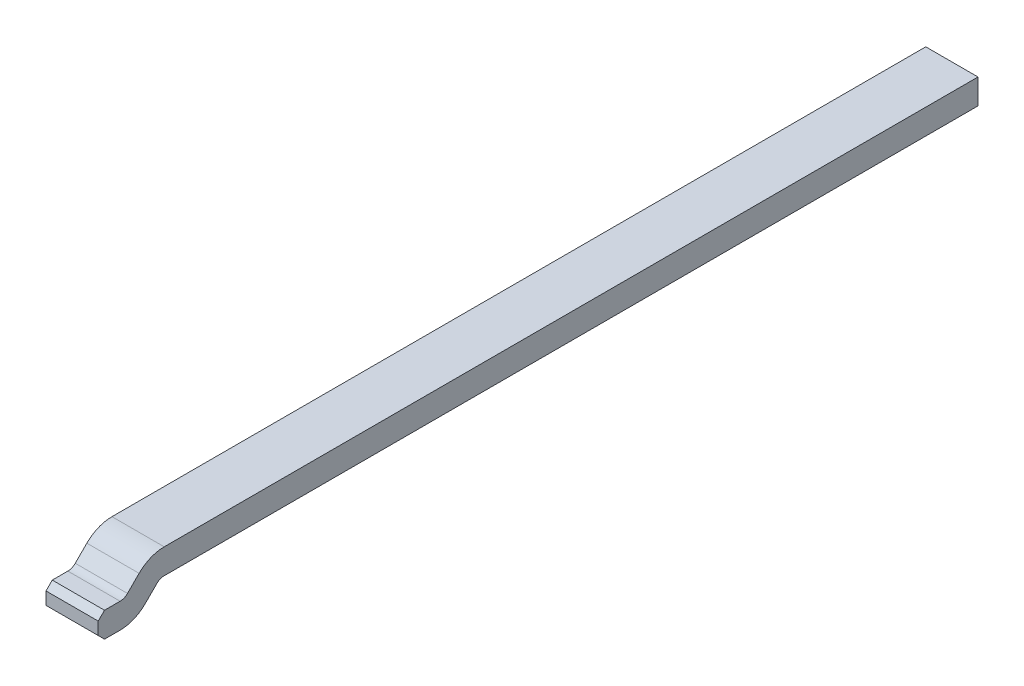
ISO-10303-21;
HEADER;
FILE_DESCRIPTION(('STEP AP214'),'2;1');
FILE_NAME('part.step','',(''),(''),'','','');
FILE_SCHEMA(('AUTOMOTIVE_DESIGN { 1 0 10303 214 1 1 1 1 }'));
ENDSEC;
DATA;
#1=APPLICATION_CONTEXT('core data for automotive mechanical design processes');
#2=APPLICATION_PROTOCOL_DEFINITION('international standard','automotive_design',2000,#1);
#3=PRODUCT_CONTEXT('',#1,'mechanical');
#4=PRODUCT('Part','Part','',(#3));
#5=PRODUCT_RELATED_PRODUCT_CATEGORY('part','',(#4));
#6=PRODUCT_DEFINITION_FORMATION('','',#4);
#7=PRODUCT_DEFINITION_CONTEXT('part definition',#1,'design');
#8=PRODUCT_DEFINITION('design','',#6,#7);
#9=PRODUCT_DEFINITION_SHAPE('','',#8);
#10=(LENGTH_UNIT() NAMED_UNIT(*) SI_UNIT(.MILLI.,.METRE.));
#11=(NAMED_UNIT(*) PLANE_ANGLE_UNIT() SI_UNIT($,.RADIAN.));
#12=(NAMED_UNIT(*) SI_UNIT($,.STERADIAN.) SOLID_ANGLE_UNIT());
#13=UNCERTAINTY_MEASURE_WITH_UNIT(LENGTH_MEASURE(1.E-05),#10,'distance_accuracy_value','');
#14=(GEOMETRIC_REPRESENTATION_CONTEXT(3) GLOBAL_UNCERTAINTY_ASSIGNED_CONTEXT((#13)) GLOBAL_UNIT_ASSIGNED_CONTEXT((#10,
#11,#12)) REPRESENTATION_CONTEXT('',''));
#15=CARTESIAN_POINT('',(0.,0.,0.));
#16=DIRECTION('',(0.,0.,1.));
#17=DIRECTION('',(1.,0.,0.));
#18=AXIS2_PLACEMENT_3D('',#15,#16,#17);
#19=CARTESIAN_POINT('',(16.66210814532,12.93951558355,-10.71169883308));
#20=DIRECTION('',(-1.,0.,0.));
#21=DIRECTION('',(0.,1.,0.));
#22=AXIS2_PLACEMENT_3D('',#19,#20,#21);
#23=PLANE('',#22);
#24=DIRECTION('',(0.,1.,0.));
#25=VECTOR('',#24,1.);
#26=CARTESIAN_POINT('',(16.66210814532,11.48941215274,-9.67169883308));
#27=LINE('',#26,#25);
#28=CARTESIAN_POINT('',(16.6621081893693,13.39951558355,-9.67169883308001));
#29=VERTEX_POINT('',#28);
#30=CARTESIAN_POINT('',(16.662108189363,13.51951558355,-9.67169883308001));
#31=VERTEX_POINT('',#30);
#32=EDGE_CURVE('E28',#29,#31,#27,.T.);
#33=ORIENTED_EDGE('',*,*,#32,.F.);
#34=DIRECTION('',(0.,0.,-1.));
#35=VECTOR('',#34,1.);
#36=CARTESIAN_POINT('',(16.66210823377,13.39951558355,-5.731698833076));
#37=LINE('',#36,#35);
#38=CARTESIAN_POINT('',(16.6621082334123,13.39951558355,-5.77711513867901));
#39=VERTEX_POINT('',#38);
#40=EDGE_CURVE('E127',#39,#29,#37,.T.);
#41=ORIENTED_EDGE('',*,*,#40,.F.);
#42=CARTESIAN_POINT('',(16.66210823377,13.34951558355,-5.777115138679));
#43=DIRECTION('',(-1.,0.,0.));
#44=DIRECTION('',(0.,0.,1.));
#45=AXIS2_PLACEMENT_3D('',#42,#43,#44);
#46=CIRCLE('',#45,0.05);
#47=CARTESIAN_POINT('',(16.6621082334123,13.3848709226099,-5.74175979962007));
#48=VERTEX_POINT('',#47);
#49=EDGE_CURVE('E219',#48,#39,#46,.T.);
#50=ORIENTED_EDGE('',*,*,#49,.F.);
#51=DIRECTION('',(0.,0.707106781180048,-0.707106781193047));
#52=VECTOR('',#51,1.);
#53=CARTESIAN_POINT('',(16.66210823377,13.32930743075,-5.686196307759));
#54=LINE('',#53,#52);
#55=CARTESIAN_POINT('',(16.6621082334123,13.3293074307494,-5.6861963077595));
#56=VERTEX_POINT('',#55);
#57=EDGE_CURVE('E239',#56,#48,#54,.T.);
#58=ORIENTED_EDGE('',*,*,#57,.F.);
#59=CARTESIAN_POINT('',(16.66210823377,13.44951558355,-5.565988154957));
#60=DIRECTION('',(1.,0.,0.));
#61=DIRECTION('',(0.,0.,1.));
#62=AXIS2_PLACEMENT_3D('',#59,#60,#61);
#63=CIRCLE('',#62,0.17);
#64=CARTESIAN_POINT('',(16.6621082334123,13.27951558355,-5.565988154957));
#65=VERTEX_POINT('',#64);
#66=EDGE_CURVE('E232',#65,#56,#63,.T.);
#67=ORIENTED_EDGE('',*,*,#66,.F.);
#68=DIRECTION('',(0.,0.,-1.));
#69=VECTOR('',#68,1.);
#70=CARTESIAN_POINT('',(16.66210823377,13.27951558355,-5.731698833076));
#71=LINE('',#70,#69);
#72=CARTESIAN_POINT('',(16.6621082334123,13.27951558355,-5.491404460561));
#73=VERTEX_POINT('',#72);
#74=EDGE_CURVE('E87',#73,#65,#71,.T.);
#75=ORIENTED_EDGE('',*,*,#74,.F.);
#76=DIRECTION('',(0.,-0.707106781186548,-0.707106781186548));
#77=VECTOR('',#76,1.);
#78=CARTESIAN_POINT('',(16.66210823377,13.30951558355,-5.461404460561));
#79=LINE('',#78,#77);
#80=CARTESIAN_POINT('',(16.6621082334123,13.30951558355,-5.461404460561));
#81=VERTEX_POINT('',#80);
#82=EDGE_CURVE('E230',#81,#73,#79,.T.);
#83=ORIENTED_EDGE('',*,*,#82,.F.);
#84=DIRECTION('',(0.,-1.,0.));
#85=VECTOR('',#84,1.);
#86=CARTESIAN_POINT('',(16.66210823377,13.39951558355,-5.461404460561));
#87=LINE('',#86,#85);
#88=CARTESIAN_POINT('',(16.6621082334123,13.36951558355,-5.461404460561));
#89=VERTEX_POINT('',#88);
#90=EDGE_CURVE('E215',#89,#81,#87,.T.);
#91=ORIENTED_EDGE('',*,*,#90,.F.);
#92=DIRECTION('',(0.,-0.707106781186548,0.707106781186548));
#93=VECTOR('',#92,1.);
#94=CARTESIAN_POINT('',(16.66210823377,13.39951558355,-5.491404460561));
#95=LINE('',#94,#93);
#96=CARTESIAN_POINT('',(16.6621082334123,13.39951558355,-5.491404460561));
#97=VERTEX_POINT('',#96);
#98=EDGE_CURVE('E291',#97,#89,#95,.T.);
#99=ORIENTED_EDGE('',*,*,#98,.F.);
#100=DIRECTION('',(0.,0.,1.));
#101=VECTOR('',#100,1.);
#102=CARTESIAN_POINT('',(16.66210823377,13.39951558355,-5.731698833076));
#103=LINE('',#102,#101);
#104=CARTESIAN_POINT('',(16.6621082334123,13.39951558355,-5.565988154957));
#105=VERTEX_POINT('',#104);
#106=EDGE_CURVE('E287',#105,#97,#103,.T.);
#107=ORIENTED_EDGE('',*,*,#106,.F.);
#108=CARTESIAN_POINT('',(16.66210823377,13.44951558355,-5.565988154957));
#109=DIRECTION('',(-1.,0.,0.));
#110=DIRECTION('',(0.,0.,-1.));
#111=AXIS2_PLACEMENT_3D('',#108,#109,#110);
#112=CIRCLE('',#111,0.05);
#113=CARTESIAN_POINT('',(16.6621082334123,13.4141602444906,-5.60134349401644));
#114=VERTEX_POINT('',#113);
#115=EDGE_CURVE('E299',#114,#105,#112,.T.);
#116=ORIENTED_EDGE('',*,*,#115,.F.);
#117=DIRECTION('',(0.,-0.707106781180048,0.707106781193047));
#118=VECTOR('',#117,1.);
#119=CARTESIAN_POINT('',(16.66210823377,13.46972373635,-5.656906985878));
#120=LINE('',#119,#118);
#121=CARTESIAN_POINT('',(16.6621082334123,13.4697237363508,-5.65690698587733));
#122=VERTEX_POINT('',#121);
#123=EDGE_CURVE('E190',#122,#114,#120,.T.);
#124=ORIENTED_EDGE('',*,*,#123,.F.);
#125=CARTESIAN_POINT('',(16.66210823377,13.34951558355,-5.777115138679));
#126=DIRECTION('',(1.,0.,0.));
#127=DIRECTION('',(0.,0.,1.));
#128=AXIS2_PLACEMENT_3D('',#125,#126,#127);
#129=CIRCLE('',#128,0.17);
#130=CARTESIAN_POINT('',(16.6621082334123,13.51951558355,-5.77711513867901));
#131=VERTEX_POINT('',#130);
#132=EDGE_CURVE('E183',#131,#122,#129,.T.);
#133=ORIENTED_EDGE('',*,*,#132,.F.);
#134=DIRECTION('',(0.,0.,1.));
#135=VECTOR('',#134,1.);
#136=CARTESIAN_POINT('',(16.66210823377,13.51951558355,-7.369063364689));
#137=LINE('',#136,#135);
#138=EDGE_CURVE('E175',#31,#131,#137,.T.);
#139=ORIENTED_EDGE('',*,*,#138,.F.);
#140=EDGE_LOOP('',(#33,#41,#50,#58,#67,#75,#83,#91,#99,#107,#116,#124,#133,#139));
#141=FACE_BOUND('',#140,.T.);
#142=ADVANCED_FACE('F17',(#141),#23,.T.);
#143=CARTESIAN_POINT('',(16.91210814532,12.93951558355,-11.91169883308));
#144=DIRECTION('',(1.,0.,0.));
#145=DIRECTION('',(0.,0.,-1.));
#146=AXIS2_PLACEMENT_3D('',#143,#144,#145);
#147=PLANE('',#146);
#148=DIRECTION('',(0.,0.,-1.));
#149=VECTOR('',#148,1.);
#150=CARTESIAN_POINT('',(16.91210823377,13.39951558355,-12.98169883308));
#151=LINE('',#150,#149);
#152=CARTESIAN_POINT('',(16.9121082334123,13.39951558355,-5.77711513867901));
#153=VERTEX_POINT('',#152);
#154=CARTESIAN_POINT('',(16.9121082334123,13.39951558355,-9.67169883308001));
#155=VERTEX_POINT('',#154);
#156=EDGE_CURVE('E119',#153,#155,#151,.T.);
#157=ORIENTED_EDGE('',*,*,#156,.T.);
#158=DIRECTION('',(0.,1.,0.));
#159=VECTOR('',#158,1.);
#160=CARTESIAN_POINT('',(16.91210823377,11.48941215274,-9.67169883308));
#161=LINE('',#160,#159);
#162=CARTESIAN_POINT('',(16.9121082334123,13.51951558355,-9.67169883308001));
#163=VERTEX_POINT('',#162);
#164=EDGE_CURVE('E11',#155,#163,#161,.T.);
#165=ORIENTED_EDGE('',*,*,#164,.T.);
#166=DIRECTION('',(0.,0.,-1.));
#167=VECTOR('',#166,1.);
#168=CARTESIAN_POINT('',(16.91210823377,13.51951558355,-7.369063364689));
#169=LINE('',#168,#167);
#170=CARTESIAN_POINT('',(16.9121082334123,13.51951558355,-5.77711513867901));
#171=VERTEX_POINT('',#170);
#172=EDGE_CURVE('E165',#171,#163,#169,.T.);
#173=ORIENTED_EDGE('',*,*,#172,.F.);
#174=CARTESIAN_POINT('',(16.91210823377,13.34951558355,-5.777115138679));
#175=DIRECTION('',(1.,0.,0.));
#176=DIRECTION('',(0.,0.,1.));
#177=AXIS2_PLACEMENT_3D('',#174,#175,#176);
#178=CIRCLE('',#177,0.17);
#179=CARTESIAN_POINT('',(16.9121082334123,13.4697237363509,-5.65690698587746));
#180=VERTEX_POINT('',#179);
#181=EDGE_CURVE('E21',#171,#180,#178,.T.);
#182=ORIENTED_EDGE('',*,*,#181,.T.);
#183=DIRECTION('',(0.,-0.707106781174048,0.707106781199048));
#184=VECTOR('',#183,1.);
#185=CARTESIAN_POINT('',(16.91210823377,13.46972373635,-5.656906985878));
#186=LINE('',#185,#184);
#187=CARTESIAN_POINT('',(16.9121082334123,13.4141602444907,-5.60134349401622));
#188=VERTEX_POINT('',#187);
#189=EDGE_CURVE('E203',#180,#188,#186,.T.);
#190=ORIENTED_EDGE('',*,*,#189,.T.);
#191=CARTESIAN_POINT('',(16.91210823377,13.44951558355,-5.565988154957));
#192=DIRECTION('',(-1.,0.,0.));
#193=DIRECTION('',(0.,0.,-1.));
#194=AXIS2_PLACEMENT_3D('',#191,#192,#193);
#195=CIRCLE('',#194,0.05);
#196=CARTESIAN_POINT('',(16.9121082334123,13.39951558355,-5.565988154957));
#197=VERTEX_POINT('',#196);
#198=EDGE_CURVE('E282',#188,#197,#195,.T.);
#199=ORIENTED_EDGE('',*,*,#198,.T.);
#200=DIRECTION('',(0.,0.,1.));
#201=VECTOR('',#200,1.);
#202=CARTESIAN_POINT('',(16.91210823377,13.39951558355,-12.98169883308));
#203=LINE('',#202,#201);
#204=CARTESIAN_POINT('',(16.9121082334123,13.39951558355,-5.491404460561));
#205=VERTEX_POINT('',#204);
#206=EDGE_CURVE('E295',#197,#205,#203,.T.);
#207=ORIENTED_EDGE('',*,*,#206,.T.);
#208=DIRECTION('',(0.,-0.707106781186548,0.707106781186548));
#209=VECTOR('',#208,1.);
#210=CARTESIAN_POINT('',(16.91210823377,13.39951558355,-5.491404460561));
#211=LINE('',#210,#209);
#212=CARTESIAN_POINT('',(16.9121082334123,13.36951558355,-5.461404460561));
#213=VERTEX_POINT('',#212);
#214=EDGE_CURVE('E211',#205,#213,#211,.T.);
#215=ORIENTED_EDGE('',*,*,#214,.T.);
#216=DIRECTION('',(0.,-1.,0.));
#217=VECTOR('',#216,1.);
#218=CARTESIAN_POINT('',(16.91210823377,13.67951558355,-5.461404460561));
#219=LINE('',#218,#217);
#220=CARTESIAN_POINT('',(16.9121082334123,13.30951558355,-5.461404460561));
#221=VERTEX_POINT('',#220);
#222=EDGE_CURVE('E207',#213,#221,#219,.T.);
#223=ORIENTED_EDGE('',*,*,#222,.T.);
#224=DIRECTION('',(0.,-0.707106781186548,-0.707106781186548));
#225=VECTOR('',#224,1.);
#226=CARTESIAN_POINT('',(16.91210823377,13.30951558355,-5.461404460561));
#227=LINE('',#226,#225);
#228=CARTESIAN_POINT('',(16.9121082334123,13.27951558355,-5.491404460561));
#229=VERTEX_POINT('',#228);
#230=EDGE_CURVE('E71',#221,#229,#227,.T.);
#231=ORIENTED_EDGE('',*,*,#230,.T.);
#232=DIRECTION('',(0.,0.,-1.));
#233=VECTOR('',#232,1.);
#234=CARTESIAN_POINT('',(16.91210823377,13.27951558355,-12.98169883308));
#235=LINE('',#234,#233);
#236=CARTESIAN_POINT('',(16.9121082334123,13.27951558355,-5.565988154957));
#237=VERTEX_POINT('',#236);
#238=EDGE_CURVE('E227',#229,#237,#235,.T.);
#239=ORIENTED_EDGE('',*,*,#238,.T.);
#240=CARTESIAN_POINT('',(16.91210823377,13.44951558355,-5.565988154957));
#241=DIRECTION('',(1.,0.,0.));
#242=DIRECTION('',(0.,0.,1.));
#243=AXIS2_PLACEMENT_3D('',#240,#241,#242);
#244=CIRCLE('',#243,0.17);
#245=CARTESIAN_POINT('',(16.9121082334123,13.3293074307494,-5.68619630775951));
#246=VERTEX_POINT('',#245);
#247=EDGE_CURVE('E236',#237,#246,#244,.T.);
#248=ORIENTED_EDGE('',*,*,#247,.T.);
#249=DIRECTION('',(0.,0.707106781180048,-0.707106781193047));
#250=VECTOR('',#249,1.);
#251=CARTESIAN_POINT('',(16.91210823377,13.32930743075,-5.686196307759));
#252=LINE('',#251,#250);
#253=CARTESIAN_POINT('',(16.9121082334123,13.3848709226099,-5.74175979962007));
#254=VERTEX_POINT('',#253);
#255=EDGE_CURVE('E252',#246,#254,#252,.T.);
#256=ORIENTED_EDGE('',*,*,#255,.T.);
#257=CARTESIAN_POINT('',(16.91210823377,13.34951558355,-5.777115138679));
#258=DIRECTION('',(-1.,0.,0.));
#259=DIRECTION('',(0.,0.,1.));
#260=AXIS2_PLACEMENT_3D('',#257,#258,#259);
#261=CIRCLE('',#260,0.05);
#262=EDGE_CURVE('E216',#254,#153,#261,.T.);
#263=ORIENTED_EDGE('',*,*,#262,.T.);
#264=EDGE_LOOP('',(#157,#165,#173,#182,#190,#199,#207,#215,#223,#231,#239,#248,#256,#263));
#265=FACE_BOUND('',#264,.T.);
#266=ADVANCED_FACE('F167',(#265),#147,.T.);
#267=CARTESIAN_POINT('',(13.11210817501,5.079903349409,-9.67169883308));
#268=DIRECTION('',(0.,0.,-1.));
#269=DIRECTION('',(-1.,0.,0.));
#270=AXIS2_PLACEMENT_3D('',#267,#268,#269);
#271=PLANE('',#270);
#272=DIRECTION('',(1.,0.,0.));
#273=VECTOR('',#272,1.);
#274=CARTESIAN_POINT('',(12.51210817501,13.39951558355,-9.67169883308));
#275=LINE('',#274,#273);
#276=EDGE_CURVE('E224',#29,#155,#275,.T.);
#277=ORIENTED_EDGE('',*,*,#276,.F.);
#278=ORIENTED_EDGE('',*,*,#32,.T.);
#279=DIRECTION('',(-1.,0.,0.));
#280=VECTOR('',#279,1.);
#281=CARTESIAN_POINT('',(13.0621082047,13.51951558355,-9.67169883308));
#282=LINE('',#281,#280);
#283=EDGE_CURVE('E248',#163,#31,#282,.T.);
#284=ORIENTED_EDGE('',*,*,#283,.F.);
#285=ORIENTED_EDGE('',*,*,#164,.F.);
#286=EDGE_LOOP('',(#277,#278,#284,#285));
#287=FACE_BOUND('',#286,.T.);
#288=ADVANCED_FACE('F450',(#287),#271,.T.);
#289=CARTESIAN_POINT('',(12.5121082047,13.39951558355,-11.38169883308));
#290=DIRECTION('',(0.,1.,0.));
#291=DIRECTION('',(1.,0.,0.));
#292=AXIS2_PLACEMENT_3D('',#289,#290,#291);
#293=PLANE('',#292);
#294=ORIENTED_EDGE('',*,*,#156,.F.);
#295=DIRECTION('',(1.,0.,0.));
#296=VECTOR('',#295,1.);
#297=CARTESIAN_POINT('',(12.5121082047,13.39951558355,-5.777115138679));
#298=LINE('',#297,#296);
#299=EDGE_CURVE('E174',#39,#153,#298,.T.);
#300=ORIENTED_EDGE('',*,*,#299,.F.);
#301=ORIENTED_EDGE('',*,*,#40,.T.);
#302=ORIENTED_EDGE('',*,*,#276,.T.);
#303=EDGE_LOOP('',(#294,#300,#301,#302));
#304=FACE_BOUND('',#303,.T.);
#305=ADVANCED_FACE('F261',(#304),#293,.F.);
#306=CARTESIAN_POINT('',(12.5121082047,13.34951558355,-5.777115138679));
#307=DIRECTION('',(1.,0.,0.));
#308=DIRECTION('',(0.,0.,1.));
#309=AXIS2_PLACEMENT_3D('',#306,#307,#308);
#310=CYLINDRICAL_SURFACE('',#309,0.05);
#311=ORIENTED_EDGE('',*,*,#299,.T.);
#312=ORIENTED_EDGE('',*,*,#262,.F.);
#313=DIRECTION('',(1.,0.,0.));
#314=VECTOR('',#313,1.);
#315=CARTESIAN_POINT('',(12.5121082047,13.38487092261,-5.74175979962));
#316=LINE('',#315,#314);
#317=EDGE_CURVE('E249',#48,#254,#316,.T.);
#318=ORIENTED_EDGE('',*,*,#317,.F.);
#319=ORIENTED_EDGE('',*,*,#49,.T.);
#320=EDGE_LOOP('',(#311,#312,#318,#319));
#321=FACE_BOUND('',#320,.T.);
#322=ADVANCED_FACE('F258',(#321),#310,.F.);
#323=CARTESIAN_POINT('',(13.0621082047,13.51951558355,-7.369063364689));
#324=DIRECTION('',(0.,1.,0.));
#325=DIRECTION('',(1.,0.,0.));
#326=AXIS2_PLACEMENT_3D('',#323,#324,#325);
#327=PLANE('',#326);
#328=ORIENTED_EDGE('',*,*,#283,.T.);
#329=ORIENTED_EDGE('',*,*,#138,.T.);
#330=DIRECTION('',(1.,0.,0.));
#331=VECTOR('',#330,1.);
#332=CARTESIAN_POINT('',(13.0621082047,13.51951558355,-5.777115138679));
#333=LINE('',#332,#331);
#334=EDGE_CURVE('E178',#131,#171,#333,.T.);
#335=ORIENTED_EDGE('',*,*,#334,.T.);
#336=ORIENTED_EDGE('',*,*,#172,.T.);
#337=EDGE_LOOP('',(#328,#329,#335,#336));
#338=FACE_BOUND('',#337,.T.);
#339=ADVANCED_FACE('F179',(#338),#327,.T.);
#340=CARTESIAN_POINT('',(16.91210823377,13.34951558355,-5.777115138679));
#341=DIRECTION('',(1.,0.,0.));
#342=DIRECTION('',(0.,0.,1.));
#343=AXIS2_PLACEMENT_3D('',#340,#341,#342);
#344=CYLINDRICAL_SURFACE('',#343,0.17);
#345=DIRECTION('',(1.,0.,0.));
#346=VECTOR('',#345,1.);
#347=CARTESIAN_POINT('',(16.91210823377,13.469723736351,-5.656906985877));
#348=LINE('',#347,#346);
#349=EDGE_CURVE('E187',#122,#180,#348,.T.);
#350=ORIENTED_EDGE('',*,*,#349,.T.);
#351=ORIENTED_EDGE('',*,*,#181,.F.);
#352=ORIENTED_EDGE('',*,*,#334,.F.);
#353=ORIENTED_EDGE('',*,*,#132,.T.);
#354=EDGE_LOOP('',(#350,#351,#352,#353));
#355=FACE_BOUND('',#354,.T.);
#356=ADVANCED_FACE('F185',(#355),#344,.T.);
#357=CARTESIAN_POINT('',(16.91210823377,13.39951558355,-5.586698833076));
#358=DIRECTION('',(0.,0.707106781186048,0.707106781187048));
#359=DIRECTION('',(1.,0.,0.));
#360=AXIS2_PLACEMENT_3D('',#357,#358,#359);
#361=PLANE('',#360);
#362=DIRECTION('',(1.,0.,0.));
#363=VECTOR('',#362,1.);
#364=CARTESIAN_POINT('',(16.91210823377,13.414160244491,-5.601343494016));
#365=LINE('',#364,#363);
#366=EDGE_CURVE('E286',#114,#188,#365,.T.);
#367=ORIENTED_EDGE('',*,*,#366,.T.);
#368=ORIENTED_EDGE('',*,*,#189,.F.);
#369=ORIENTED_EDGE('',*,*,#349,.F.);
#370=ORIENTED_EDGE('',*,*,#123,.T.);
#371=EDGE_LOOP('',(#367,#368,#369,#370));
#372=FACE_BOUND('',#371,.T.);
#373=ADVANCED_FACE('F420',(#372),#361,.T.);
#374=CARTESIAN_POINT('',(16.91210823377,13.44951558355,-5.565988154957));
#375=DIRECTION('',(-1.,0.,0.));
#376=DIRECTION('',(0.,0.,-1.));
#377=AXIS2_PLACEMENT_3D('',#374,#375,#376);
#378=CYLINDRICAL_SURFACE('',#377,0.05);
#379=DIRECTION('',(1.,0.,0.));
#380=VECTOR('',#379,1.);
#381=CARTESIAN_POINT('',(17.56534248199,13.39951558355,-5.565988154957));
#382=LINE('',#381,#380);
#383=EDGE_CURVE('E311',#105,#197,#382,.T.);
#384=ORIENTED_EDGE('',*,*,#383,.T.);
#385=ORIENTED_EDGE('',*,*,#198,.F.);
#386=ORIENTED_EDGE('',*,*,#366,.F.);
#387=ORIENTED_EDGE('',*,*,#115,.T.);
#388=EDGE_LOOP('',(#384,#385,#386,#387));
#389=FACE_BOUND('',#388,.T.);
#390=ADVANCED_FACE('F415',(#389),#378,.F.);
#391=CARTESIAN_POINT('',(17.56534248199,13.39951558355,-5.535988154957));
#392=DIRECTION('',(0.,-1.,-1.402976681707E-13));
#393=DIRECTION('',(0.,1.402976681707E-13,-1.));
#394=AXIS2_PLACEMENT_3D('',#391,#392,#393);
#395=PLANE('',#394);
#396=ORIENTED_EDGE('',*,*,#206,.F.);
#397=ORIENTED_EDGE('',*,*,#383,.F.);
#398=ORIENTED_EDGE('',*,*,#106,.T.);
#399=DIRECTION('',(-1.,0.,0.));
#400=VECTOR('',#399,1.);
#401=CARTESIAN_POINT('',(16.91210823377,13.39951558355,-5.491404460561));
#402=LINE('',#401,#400);
#403=EDGE_CURVE('E214',#205,#97,#402,.T.);
#404=ORIENTED_EDGE('',*,*,#403,.F.);
#405=EDGE_LOOP('',(#396,#397,#398,#404));
#406=FACE_BOUND('',#405,.T.);
#407=ADVANCED_FACE('F326',(#406),#395,.F.);
#408=CARTESIAN_POINT('',(16.91210823377,13.36951558355,-5.461404460561));
#409=DIRECTION('',(0.,0.707106781186048,0.707106781187048));
#410=DIRECTION('',(1.,0.,0.));
#411=AXIS2_PLACEMENT_3D('',#408,#409,#410);
#412=PLANE('',#411);
#413=DIRECTION('',(-1.,0.,0.));
#414=VECTOR('',#413,1.);
#415=CARTESIAN_POINT('',(16.91210823377,13.36951558355,-5.461404460561));
#416=LINE('',#415,#414);
#417=EDGE_CURVE('E210',#213,#89,#416,.T.);
#418=ORIENTED_EDGE('',*,*,#417,.F.);
#419=ORIENTED_EDGE('',*,*,#214,.F.);
#420=ORIENTED_EDGE('',*,*,#403,.T.);
#421=ORIENTED_EDGE('',*,*,#98,.T.);
#422=EDGE_LOOP('',(#418,#419,#420,#421));
#423=FACE_BOUND('',#422,.T.);
#424=ADVANCED_FACE('F19',(#423),#412,.T.);
#425=CARTESIAN_POINT('',(16.91210823377,13.27951558355,-5.461404460561));
#426=DIRECTION('',(0.,0.,1.));
#427=DIRECTION('',(1.,0.,0.));
#428=AXIS2_PLACEMENT_3D('',#425,#426,#427);
#429=PLANE('',#428);
#430=DIRECTION('',(1.,0.,0.));
#431=VECTOR('',#430,1.);
#432=CARTESIAN_POINT('',(16.91210823377,13.30951558355,-5.461404460561));
#433=LINE('',#432,#431);
#434=EDGE_CURVE('E298',#81,#221,#433,.T.);
#435=ORIENTED_EDGE('',*,*,#434,.T.);
#436=ORIENTED_EDGE('',*,*,#222,.F.);
#437=ORIENTED_EDGE('',*,*,#417,.T.);
#438=ORIENTED_EDGE('',*,*,#90,.T.);
#439=EDGE_LOOP('',(#435,#436,#437,#438));
#440=FACE_BOUND('',#439,.T.);
#441=ADVANCED_FACE('F334',(#440),#429,.T.);
#442=CARTESIAN_POINT('',(16.91210823377,13.30951558355,-5.461404460561));
#443=DIRECTION('',(0.,0.707106781187048,-0.707106781186048));
#444=DIRECTION('',(-1.,0.,0.));
#445=AXIS2_PLACEMENT_3D('',#442,#443,#444);
#446=PLANE('',#445);
#447=ORIENTED_EDGE('',*,*,#434,.F.);
#448=ORIENTED_EDGE('',*,*,#82,.T.);
#449=DIRECTION('',(-1.,0.,0.));
#450=VECTOR('',#449,1.);
#451=CARTESIAN_POINT('',(16.91210823377,13.27951558355,-5.491404460561));
#452=LINE('',#451,#450);
#453=EDGE_CURVE('E228',#229,#73,#452,.T.);
#454=ORIENTED_EDGE('',*,*,#453,.F.);
#455=ORIENTED_EDGE('',*,*,#230,.F.);
#456=EDGE_LOOP('',(#447,#448,#454,#455));
#457=FACE_BOUND('',#456,.T.);
#458=ADVANCED_FACE('F338',(#457),#446,.F.);
#459=CARTESIAN_POINT('',(16.91210823377,13.27951558355,-5.661404460561));
#460=DIRECTION('',(0.,-1.,0.));
#461=DIRECTION('',(0.,0.,-1.));
#462=AXIS2_PLACEMENT_3D('',#459,#460,#461);
#463=PLANE('',#462);
#464=ORIENTED_EDGE('',*,*,#453,.T.);
#465=ORIENTED_EDGE('',*,*,#74,.T.);
#466=DIRECTION('',(-1.,0.,0.));
#467=VECTOR('',#466,1.);
#468=CARTESIAN_POINT('',(16.91210823377,13.27951558355,-5.565988154957));
#469=LINE('',#468,#467);
#470=EDGE_CURVE('E235',#237,#65,#469,.T.);
#471=ORIENTED_EDGE('',*,*,#470,.F.);
#472=ORIENTED_EDGE('',*,*,#238,.F.);
#473=EDGE_LOOP('',(#464,#465,#471,#472));
#474=FACE_BOUND('',#473,.T.);
#475=ADVANCED_FACE('F409',(#474),#463,.T.);
#476=CARTESIAN_POINT('',(16.91210823377,13.44951558355,-5.565988154957));
#477=DIRECTION('',(1.,0.,0.));
#478=DIRECTION('',(0.,0.,1.));
#479=AXIS2_PLACEMENT_3D('',#476,#477,#478);
#480=CYLINDRICAL_SURFACE('',#479,0.17);
#481=DIRECTION('',(-1.,0.,0.));
#482=VECTOR('',#481,1.);
#483=CARTESIAN_POINT('',(16.91210823377,13.329307430749,-5.68619630776));
#484=LINE('',#483,#482);
#485=EDGE_CURVE('E245',#246,#56,#484,.T.);
#486=ORIENTED_EDGE('',*,*,#485,.F.);
#487=ORIENTED_EDGE('',*,*,#247,.F.);
#488=ORIENTED_EDGE('',*,*,#470,.T.);
#489=ORIENTED_EDGE('',*,*,#66,.T.);
#490=EDGE_LOOP('',(#486,#487,#488,#489));
#491=FACE_BOUND('',#490,.T.);
#492=ADVANCED_FACE('F474',(#491),#480,.T.);
#493=CARTESIAN_POINT('',(16.91210823377,13.39951558355,-5.756404460561));
#494=DIRECTION('',(0.,-0.707106781187048,-0.707106781186048));
#495=DIRECTION('',(0.,0.707106781186048,-0.707106781187048));
#496=AXIS2_PLACEMENT_3D('',#493,#494,#495);
#497=PLANE('',#496);
#498=ORIENTED_EDGE('',*,*,#317,.T.);
#499=ORIENTED_EDGE('',*,*,#255,.F.);
#500=ORIENTED_EDGE('',*,*,#485,.T.);
#501=ORIENTED_EDGE('',*,*,#57,.T.);
#502=EDGE_LOOP('',(#498,#499,#500,#501));
#503=FACE_BOUND('',#502,.T.);
#504=ADVANCED_FACE('F272',(#503),#497,.T.);
#505=CLOSED_SHELL('',(#142,#266,#288,#305,#322,#339,#356,#373,#390,#407,#424,#441,#458,#475,
#492,#504));
#506=MANIFOLD_SOLID_BREP('B1',#505);
#507=ADVANCED_BREP_SHAPE_REPRESENTATION('',(#18,#506),#14);
#508=SHAPE_DEFINITION_REPRESENTATION(#9,#507);
ENDSEC;
END-ISO-10303-21;
